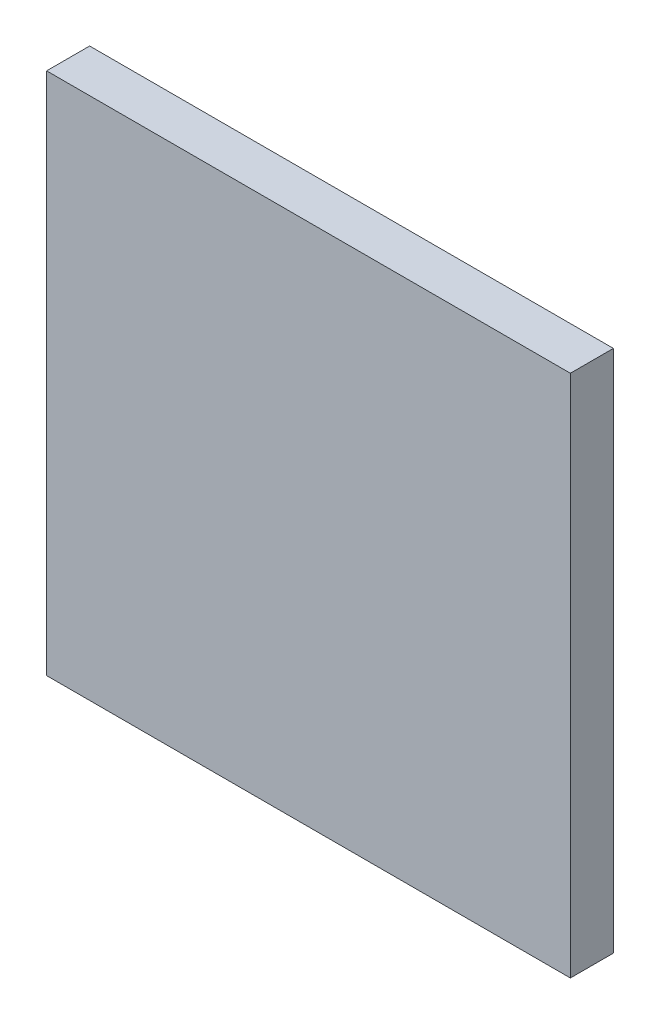
ISO-10303-21;
HEADER;
FILE_DESCRIPTION(('STEP AP214'),'2;1');
FILE_NAME('part.step','',(''),(''),'','','');
FILE_SCHEMA(('AUTOMOTIVE_DESIGN { 1 0 10303 214 1 1 1 1 }'));
ENDSEC;
DATA;
#1=APPLICATION_CONTEXT('core data for automotive mechanical design processes');
#2=APPLICATION_PROTOCOL_DEFINITION('international standard','automotive_design',2000,#1);
#3=PRODUCT_CONTEXT('',#1,'mechanical');
#4=PRODUCT('Part','Part','',(#3));
#5=PRODUCT_RELATED_PRODUCT_CATEGORY('part','',(#4));
#6=PRODUCT_DEFINITION_FORMATION('','',#4);
#7=PRODUCT_DEFINITION_CONTEXT('part definition',#1,'design');
#8=PRODUCT_DEFINITION('design','',#6,#7);
#9=PRODUCT_DEFINITION_SHAPE('','',#8);
#10=(LENGTH_UNIT() NAMED_UNIT(*) SI_UNIT(.MILLI.,.METRE.));
#11=(NAMED_UNIT(*) PLANE_ANGLE_UNIT() SI_UNIT($,.RADIAN.));
#12=(NAMED_UNIT(*) SI_UNIT($,.STERADIAN.) SOLID_ANGLE_UNIT());
#13=UNCERTAINTY_MEASURE_WITH_UNIT(LENGTH_MEASURE(1.E-05),#10,'distance_accuracy_value','');
#14=(GEOMETRIC_REPRESENTATION_CONTEXT(3) GLOBAL_UNCERTAINTY_ASSIGNED_CONTEXT((#13)) GLOBAL_UNIT_ASSIGNED_CONTEXT((#10,
#11,#12)) REPRESENTATION_CONTEXT('',''));
#15=CARTESIAN_POINT('',(0.,0.,0.));
#16=DIRECTION('',(0.,0.,1.));
#17=DIRECTION('',(1.,0.,0.));
#18=AXIS2_PLACEMENT_3D('',#15,#16,#17);
#19=CARTESIAN_POINT('',(-6.9999987,-6.9999987,1.15));
#20=DIRECTION('',(0.,0.,1.));
#21=DIRECTION('',(1.,0.,0.));
#22=AXIS2_PLACEMENT_3D('',#19,#20,#21);
#23=PLANE('',#22);
#24=DIRECTION('',(1.,0.,0.));
#25=VECTOR('',#24,1.);
#26=CARTESIAN_POINT('',(-6.9999987,7.00000124,1.15));
#27=LINE('',#26,#25);
#28=CARTESIAN_POINT('',(-6.9999987,7.00000124,1.15));
#29=VERTEX_POINT('',#28);
#30=CARTESIAN_POINT('',(7.00000124,7.00000124,1.15));
#31=VERTEX_POINT('',#30);
#32=EDGE_CURVE('E52',#29,#31,#27,.T.);
#33=ORIENTED_EDGE('',*,*,#32,.F.);
#34=DIRECTION('',(0.,1.,0.));
#35=VECTOR('',#34,1.);
#36=CARTESIAN_POINT('',(-6.9999987,-6.9999987,1.15));
#37=LINE('',#36,#35);
#38=CARTESIAN_POINT('',(-6.9999987,-6.9999987,1.15));
#39=VERTEX_POINT('',#38);
#40=EDGE_CURVE('E67',#39,#29,#37,.T.);
#41=ORIENTED_EDGE('',*,*,#40,.F.);
#42=DIRECTION('',(1.,0.,0.));
#43=VECTOR('',#42,1.);
#44=CARTESIAN_POINT('',(7.00000124,-6.9999987,1.15));
#45=LINE('',#44,#43);
#46=CARTESIAN_POINT('',(7.00000124,-6.9999987,1.15));
#47=VERTEX_POINT('',#46);
#48=EDGE_CURVE('E19',#47,#39,#45,.F.);
#49=ORIENTED_EDGE('',*,*,#48,.F.);
#50=DIRECTION('',(0.,1.,0.));
#51=VECTOR('',#50,1.);
#52=CARTESIAN_POINT('',(7.00000124,7.00000124,1.15));
#53=LINE('',#52,#51);
#54=EDGE_CURVE('E57',#31,#47,#53,.F.);
#55=ORIENTED_EDGE('',*,*,#54,.F.);
#56=EDGE_LOOP('',(#33,#41,#49,#55));
#57=FACE_BOUND('',#56,.T.);
#58=ADVANCED_FACE('F16',(#57),#23,.T.);
#59=CARTESIAN_POINT('',(7.00000124,-6.9999987,0.));
#60=DIRECTION('',(0.,-1.,0.));
#61=DIRECTION('',(0.,0.,-1.));
#62=AXIS2_PLACEMENT_3D('',#59,#60,#61);
#63=PLANE('',#62);
#64=DIRECTION('',(0.,0.,1.));
#65=VECTOR('',#64,1.);
#66=CARTESIAN_POINT('',(-6.9999987,-6.9999987,0.));
#67=LINE('',#66,#65);
#68=CARTESIAN_POINT('',(-6.9999987,-6.9999987,0.));
#69=VERTEX_POINT('',#68);
#70=EDGE_CURVE('E78',#69,#39,#67,.T.);
#71=ORIENTED_EDGE('',*,*,#70,.F.);
#72=DIRECTION('',(1.,0.,0.));
#73=VECTOR('',#72,1.);
#74=CARTESIAN_POINT('',(-6.9999987,-6.9999987,0.));
#75=LINE('',#74,#73);
#76=CARTESIAN_POINT('',(7.00000124,-6.9999987,0.));
#77=VERTEX_POINT('',#76);
#78=EDGE_CURVE('E73',#69,#77,#75,.T.);
#79=ORIENTED_EDGE('',*,*,#78,.T.);
#80=DIRECTION('',(0.,0.,-1.));
#81=VECTOR('',#80,1.);
#82=CARTESIAN_POINT('',(7.00000124,-6.9999987,0.));
#83=LINE('',#82,#81);
#84=EDGE_CURVE('E62',#47,#77,#83,.T.);
#85=ORIENTED_EDGE('',*,*,#84,.F.);
#86=ORIENTED_EDGE('',*,*,#48,.T.);
#87=EDGE_LOOP('',(#71,#79,#85,#86));
#88=FACE_BOUND('',#87,.T.);
#89=ADVANCED_FACE('F72',(#88),#63,.T.);
#90=CARTESIAN_POINT('',(7.00000124,7.00000124,0.));
#91=DIRECTION('',(1.,0.,0.));
#92=DIRECTION('',(0.,0.,-1.));
#93=AXIS2_PLACEMENT_3D('',#90,#91,#92);
#94=PLANE('',#93);
#95=ORIENTED_EDGE('',*,*,#84,.T.);
#96=DIRECTION('',(0.,1.,0.));
#97=VECTOR('',#96,1.);
#98=CARTESIAN_POINT('',(7.00000124,-6.9999987,0.));
#99=LINE('',#98,#97);
#100=CARTESIAN_POINT('',(7.00000124,7.00000124,0.));
#101=VERTEX_POINT('',#100);
#102=EDGE_CURVE('E83',#77,#101,#99,.T.);
#103=ORIENTED_EDGE('',*,*,#102,.T.);
#104=DIRECTION('',(0.,0.,1.));
#105=VECTOR('',#104,1.);
#106=CARTESIAN_POINT('',(7.00000124,7.00000124,0.));
#107=LINE('',#106,#105);
#108=EDGE_CURVE('E64',#31,#101,#107,.F.);
#109=ORIENTED_EDGE('',*,*,#108,.F.);
#110=ORIENTED_EDGE('',*,*,#54,.T.);
#111=EDGE_LOOP('',(#95,#103,#109,#110));
#112=FACE_BOUND('',#111,.T.);
#113=ADVANCED_FACE('F59',(#112),#94,.T.);
#114=CARTESIAN_POINT('',(-6.9999987,7.00000124,0.));
#115=DIRECTION('',(0.,1.,0.));
#116=DIRECTION('',(0.,0.,1.));
#117=AXIS2_PLACEMENT_3D('',#114,#115,#116);
#118=PLANE('',#117);
#119=ORIENTED_EDGE('',*,*,#108,.T.);
#120=DIRECTION('',(1.,0.,0.));
#121=VECTOR('',#120,1.);
#122=CARTESIAN_POINT('',(-6.9999987,7.00000124,0.));
#123=LINE('',#122,#121);
#124=CARTESIAN_POINT('',(-6.9999987,7.00000124,0.));
#125=VERTEX_POINT('',#124);
#126=EDGE_CURVE('E25',#101,#125,#123,.F.);
#127=ORIENTED_EDGE('',*,*,#126,.T.);
#128=DIRECTION('',(0.,0.,1.));
#129=VECTOR('',#128,1.);
#130=CARTESIAN_POINT('',(-6.9999987,7.00000124,0.));
#131=LINE('',#130,#129);
#132=EDGE_CURVE('E33',#29,#125,#131,.F.);
#133=ORIENTED_EDGE('',*,*,#132,.F.);
#134=ORIENTED_EDGE('',*,*,#32,.T.);
#135=EDGE_LOOP('',(#119,#127,#133,#134));
#136=FACE_BOUND('',#135,.T.);
#137=ADVANCED_FACE('F87',(#136),#118,.T.);
#138=CARTESIAN_POINT('',(-6.9999987,-6.9999987,0.));
#139=DIRECTION('',(-1.,0.,0.));
#140=DIRECTION('',(0.,0.,1.));
#141=AXIS2_PLACEMENT_3D('',#138,#139,#140);
#142=PLANE('',#141);
#143=ORIENTED_EDGE('',*,*,#132,.T.);
#144=DIRECTION('',(0.,1.,0.));
#145=VECTOR('',#144,1.);
#146=CARTESIAN_POINT('',(-6.9999987,-6.9999987,0.));
#147=LINE('',#146,#145);
#148=EDGE_CURVE('E10',#125,#69,#147,.F.);
#149=ORIENTED_EDGE('',*,*,#148,.T.);
#150=ORIENTED_EDGE('',*,*,#70,.T.);
#151=ORIENTED_EDGE('',*,*,#40,.T.);
#152=EDGE_LOOP('',(#143,#149,#150,#151));
#153=FACE_BOUND('',#152,.T.);
#154=ADVANCED_FACE('F90',(#153),#142,.T.);
#155=CARTESIAN_POINT('',(-6.9999987,-6.9999987,0.));
#156=DIRECTION('',(0.,0.,1.));
#157=DIRECTION('',(1.,0.,0.));
#158=AXIS2_PLACEMENT_3D('',#155,#156,#157);
#159=PLANE('',#158);
#160=ORIENTED_EDGE('',*,*,#126,.F.);
#161=ORIENTED_EDGE('',*,*,#102,.F.);
#162=ORIENTED_EDGE('',*,*,#78,.F.);
#163=ORIENTED_EDGE('',*,*,#148,.F.);
#164=EDGE_LOOP('',(#160,#161,#162,#163));
#165=FACE_BOUND('',#164,.T.);
#166=ADVANCED_FACE('F89',(#165),#159,.F.);
#167=CLOSED_SHELL('',(#58,#89,#113,#137,#154,#166));
#168=MANIFOLD_SOLID_BREP('B1',#167);
#169=ADVANCED_BREP_SHAPE_REPRESENTATION('',(#18,#168),#14);
#170=SHAPE_DEFINITION_REPRESENTATION(#9,#169);
ENDSEC;
END-ISO-10303-21;
